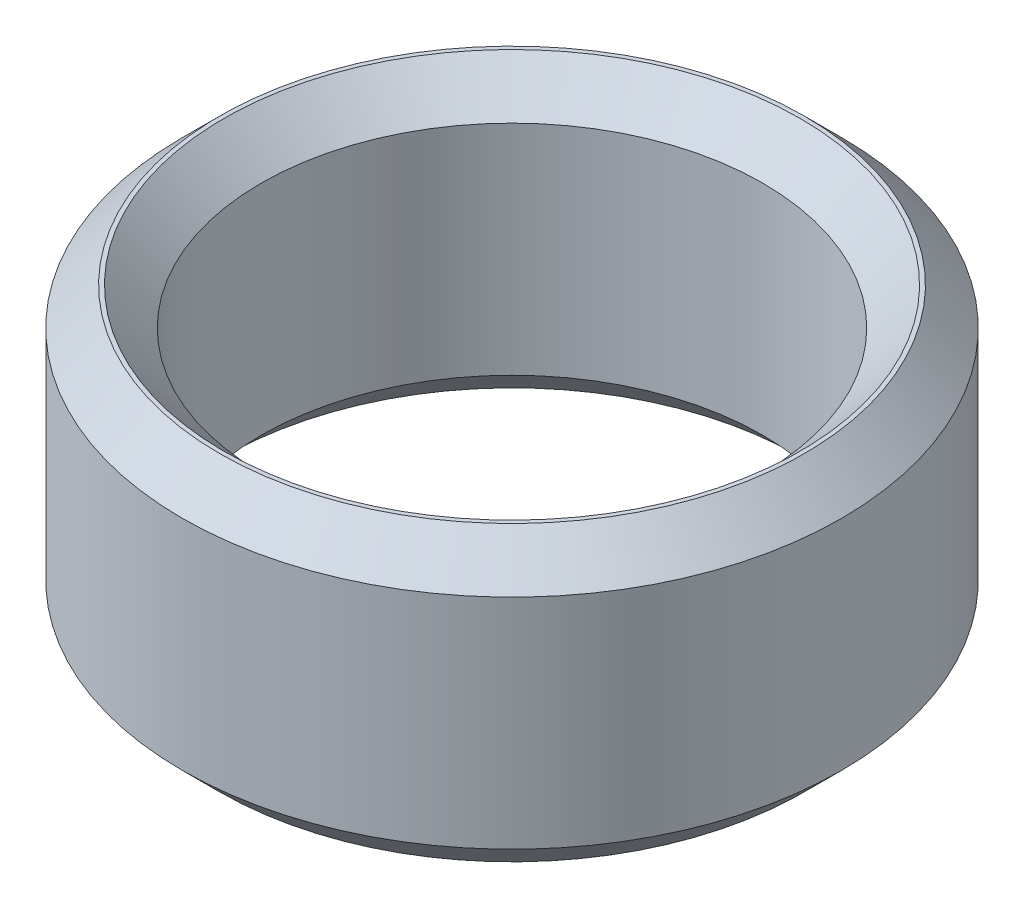
ISO-10303-21;
HEADER;
FILE_DESCRIPTION(('STEP AP214'),'2;1');
FILE_NAME('part.step','',(''),(''),'','','');
FILE_SCHEMA(('AUTOMOTIVE_DESIGN { 1 0 10303 214 1 1 1 1 }'));
ENDSEC;
DATA;
#1=APPLICATION_CONTEXT('core data for automotive mechanical design processes');
#2=APPLICATION_PROTOCOL_DEFINITION('international standard','automotive_design',2000,#1);
#3=PRODUCT_CONTEXT('',#1,'mechanical');
#4=PRODUCT('Part','Part','',(#3));
#5=PRODUCT_RELATED_PRODUCT_CATEGORY('part','',(#4));
#6=PRODUCT_DEFINITION_FORMATION('','',#4);
#7=PRODUCT_DEFINITION_CONTEXT('part definition',#1,'design');
#8=PRODUCT_DEFINITION('design','',#6,#7);
#9=PRODUCT_DEFINITION_SHAPE('','',#8);
#10=(LENGTH_UNIT() NAMED_UNIT(*) SI_UNIT(.MILLI.,.METRE.));
#11=(NAMED_UNIT(*) PLANE_ANGLE_UNIT() SI_UNIT($,.RADIAN.));
#12=(NAMED_UNIT(*) SI_UNIT($,.STERADIAN.) SOLID_ANGLE_UNIT());
#13=UNCERTAINTY_MEASURE_WITH_UNIT(LENGTH_MEASURE(1.E-05),#10,'distance_accuracy_value','');
#14=(GEOMETRIC_REPRESENTATION_CONTEXT(3) GLOBAL_UNCERTAINTY_ASSIGNED_CONTEXT((#13)) GLOBAL_UNIT_ASSIGNED_CONTEXT((#10,
#11,#12)) REPRESENTATION_CONTEXT('',''));
#15=CARTESIAN_POINT('',(0.,0.,0.));
#16=DIRECTION('',(0.,0.,1.));
#17=DIRECTION('',(1.,0.,0.));
#18=AXIS2_PLACEMENT_3D('',#15,#16,#17);
#19=CARTESIAN_POINT('',(0.,11.109307119717,0.));
#20=DIRECTION('',(0.,-1.,0.));
#21=DIRECTION('',(0.,0.,-1.));
#22=AXIS2_PLACEMENT_3D('',#19,#20,#21);
#23=CYLINDRICAL_SURFACE('',#22,12.5);
#24=CARTESIAN_POINT('',(0.,1.4161523422437,0.));
#25=DIRECTION('',(0.,1.,0.));
#26=DIRECTION('',(0.,0.,1.));
#27=AXIS2_PLACEMENT_3D('',#24,#25,#26);
#28=CIRCLE('',#27,12.5);
#29=CARTESIAN_POINT('',(0.,1.4161523422437,-12.5));
#30=VERTEX_POINT('',#29);
#31=EDGE_CURVE('E10',#30,#30,#28,.T.);
#32=CARTESIAN_POINT('',(0.,9.69315477747331,0.));
#33=DIRECTION('',(0.,1.,0.));
#34=DIRECTION('',(0.,0.,1.));
#35=AXIS2_PLACEMENT_3D('',#32,#33,#34);
#36=CIRCLE('',#35,12.5);
#37=CARTESIAN_POINT('',(0.,9.69315477747331,-12.5));
#38=VERTEX_POINT('',#37);
#39=EDGE_CURVE('E50',#38,#38,#36,.F.);
#40=CARTESIAN_POINT('',(0.,1.4161523422437,-12.5));
#41=CARTESIAN_POINT('',(0.,1.50237111761067,-12.5));
#42=CARTESIAN_POINT('',(0.,1.58858989297765,-12.5));
#43=CARTESIAN_POINT('',(0.,1.7610274437116,-12.5));
#44=CARTESIAN_POINT('',(0.,1.84724621907857,-12.5));
#45=CARTESIAN_POINT('',(0.,2.01968376981252,-12.5));
#46=CARTESIAN_POINT('',(0.,2.1059025451795,-12.5));
#47=CARTESIAN_POINT('',(0.,2.27834009591345,-12.5));
#48=CARTESIAN_POINT('',(0.,2.36455887128043,-12.5));
#49=CARTESIAN_POINT('',(0.,2.53699642201437,-12.5));
#50=CARTESIAN_POINT('',(0.,2.62321519738135,-12.5));
#51=CARTESIAN_POINT('',(0.,2.7956527481153,-12.5));
#52=CARTESIAN_POINT('',(0.,2.88187152348228,-12.5));
#53=CARTESIAN_POINT('',(0.,3.05430907421623,-12.5));
#54=CARTESIAN_POINT('',(0.,3.1405278495832,-12.5));
#55=CARTESIAN_POINT('',(0.,3.31296540031715,-12.5));
#56=CARTESIAN_POINT('',(0.,3.39918417568413,-12.5));
#57=CARTESIAN_POINT('',(0.,3.57162172641807,-12.5));
#58=CARTESIAN_POINT('',(0.,3.65784050178505,-12.5));
#59=CARTESIAN_POINT('',(0.,3.830278052519,-12.5));
#60=CARTESIAN_POINT('',(0.,3.91649682788598,-12.5));
#61=CARTESIAN_POINT('',(0.,4.08893437861993,-12.5));
#62=CARTESIAN_POINT('',(0.,4.1751531539869,-12.5));
#63=CARTESIAN_POINT('',(0.,4.34759070472085,-12.5));
#64=CARTESIAN_POINT('',(0.,4.43380948008783,-12.5));
#65=CARTESIAN_POINT('',(0.,4.60624703082178,-12.5));
#66=CARTESIAN_POINT('',(0.,4.69246580618875,-12.5));
#67=CARTESIAN_POINT('',(0.,4.8649033569227,-12.5));
#68=CARTESIAN_POINT('',(0.,4.95112213228968,-12.5));
#69=CARTESIAN_POINT('',(0.,5.12355968302363,-12.5));
#70=CARTESIAN_POINT('',(0.,5.2097784583906,-12.5));
#71=CARTESIAN_POINT('',(0.,5.38221600912455,-12.5));
#72=CARTESIAN_POINT('',(0.,5.46843478449153,-12.5));
#73=CARTESIAN_POINT('',(0.,5.64087233522548,-12.5));
#74=CARTESIAN_POINT('',(0.,5.72709111059245,-12.5));
#75=CARTESIAN_POINT('',(0.,5.8995286613264,-12.5));
#76=CARTESIAN_POINT('',(0.,5.98574743669338,-12.5));
#77=CARTESIAN_POINT('',(0.,6.15818498742733,-12.5));
#78=CARTESIAN_POINT('',(0.,6.2444037627943,-12.5));
#79=CARTESIAN_POINT('',(0.,6.41684131352825,-12.5));
#80=CARTESIAN_POINT('',(0.,6.50306008889523,-12.5));
#81=CARTESIAN_POINT('',(0.,6.67549763962918,-12.5));
#82=CARTESIAN_POINT('',(0.,6.76171641499615,-12.5));
#83=CARTESIAN_POINT('',(0.,6.9341539657301,-12.5));
#84=CARTESIAN_POINT('',(0.,7.02037274109708,-12.5));
#85=CARTESIAN_POINT('',(0.,7.19281029183103,-12.5));
#86=CARTESIAN_POINT('',(0.,7.279029067198,-12.5));
#87=CARTESIAN_POINT('',(0.,7.45146661793195,-12.5));
#88=CARTESIAN_POINT('',(0.,7.53768539329893,-12.5));
#89=CARTESIAN_POINT('',(0.,7.71012294403288,-12.5));
#90=CARTESIAN_POINT('',(0.,7.79634171939985,-12.5));
#91=CARTESIAN_POINT('',(0.,7.9687792701338,-12.5));
#92=CARTESIAN_POINT('',(0.,8.05499804550078,-12.5));
#93=CARTESIAN_POINT('',(0.,8.22743559623473,-12.5));
#94=CARTESIAN_POINT('',(0.,8.3136543716017,-12.5));
#95=CARTESIAN_POINT('',(0.,8.48609192233565,-12.5));
#96=CARTESIAN_POINT('',(0.,8.57231069770263,-12.5));
#97=CARTESIAN_POINT('',(0.,8.74474824843658,-12.5));
#98=CARTESIAN_POINT('',(0.,8.83096702380356,-12.5));
#99=CARTESIAN_POINT('',(0.,9.0034045745375,-12.5));
#100=CARTESIAN_POINT('',(0.,9.08962334990448,-12.5));
#101=CARTESIAN_POINT('',(0.,9.26206090063843,-12.5));
#102=CARTESIAN_POINT('',(0.,9.34827967600541,-12.5));
#103=CARTESIAN_POINT('',(0.,9.52071722673935,-12.5));
#104=CARTESIAN_POINT('',(0.,9.60693600210633,-12.5));
#105=CARTESIAN_POINT('',(0.,9.69315477747331,-12.5));
#106=B_SPLINE_CURVE_WITH_KNOTS('',3,(#40,#41,#42,#43,#44,#45,#46,#47,#48,#49,#50,#51,#52,#53,
#54,#55,#56,#57,#58,#59,#60,#61,#62,#63,#64,#65,#66,#67,#68,#69,#70,#71,#72,#73,#74,#75,#76,#77,
#78,#79,#80,#81,#82,#83,#84,#85,#86,#87,#88,#89,#90,#91,#92,#93,#94,#95,#96,#97,#98,#99,#100,
#101,#102,#103,#104,#105),.UNSPECIFIED.,.F.,.F.,(4,2,2,2,2,2,2,2,2,2,2,2,2,2,2,2,2,2,2,2,2,2,2,
2,2,2,2,2,2,2,2,2,4),(0.,0.258656326100925,0.517312652201851,0.775968978302776,1.0346253044037,
1.29328163050463,1.55193795660555,1.81059428270648,2.0692506088074,2.32790693490833,
2.58656326100925,2.84521958711018,3.1038759132111,3.36253223931203,3.62118856541295,
3.87984489151388,4.1385012176148,4.39715754371573,4.65581386981665,4.91447019591758,
5.1731265220185,5.43178284811943,5.69043917422035,5.94909550032128,6.2077518264222,
6.46640815252313,6.72506447862405,6.98372080472498,7.24237713082591,7.50103345692683,
7.75968978302776,8.01834610912868,8.27700243522961),.UNSPECIFIED.);
#107=EDGE_CURVE('BSEAM39',#30,#38,#106,.T.);
#108=ORIENTED_EDGE('',*,*,#31,.T.);
#109=ORIENTED_EDGE('',*,*,#39,.T.);
#110=ORIENTED_EDGE('',*,*,#107,.T.);
#111=ORIENTED_EDGE('',*,*,#107,.F.);
#112=EDGE_LOOP('',(#108,#110,#109,#111));
#113=FACE_BOUND('',#112,.T.);
#114=ADVANCED_FACE('F39',(#113),#23,.T.);
#115=CARTESIAN_POINT('',(0.,11.109307119717,0.));
#116=DIRECTION('',(0.,1.,0.));
#117=DIRECTION('',(0.,0.,1.));
#118=AXIS2_PLACEMENT_3D('',#115,#116,#117);
#119=PLANE('',#118);
#120=CARTESIAN_POINT('',(0.,11.109307119717,0.));
#121=DIRECTION('',(0.,1.,0.));
#122=DIRECTION('',(0.,0.,1.));
#123=AXIS2_PLACEMENT_3D('',#120,#121,#122);
#124=CIRCLE('',#123,10.9263904499153);
#125=CARTESIAN_POINT('',(0.,11.109307119717,10.9263904499153));
#126=VERTEX_POINT('',#125);
#127=EDGE_CURVE('E58',#126,#126,#124,.F.);
#128=ORIENTED_EDGE('',*,*,#127,.T.);
#129=EDGE_LOOP('',(#128));
#130=FACE_BOUND('',#129,.T.);
#131=CARTESIAN_POINT('',(0.,11.109307119717,0.));
#132=DIRECTION('',(0.,1.,0.));
#133=DIRECTION('',(0.,0.,1.));
#134=AXIS2_PLACEMENT_3D('',#131,#132,#133);
#135=CIRCLE('',#134,11.0838476577563);
#136=CARTESIAN_POINT('',(0.,11.109307119717,11.0838476577563));
#137=VERTEX_POINT('',#136);
#138=EDGE_CURVE('E61',#137,#137,#135,.T.);
#139=ORIENTED_EDGE('',*,*,#138,.T.);
#140=EDGE_LOOP('',(#139));
#141=FACE_BOUND('',#140,.T.);
#142=ADVANCED_FACE('F88',(#130,#141),#119,.T.);
#143=CARTESIAN_POINT('',(0.,0.,0.));
#144=DIRECTION('',(0.,1.,0.));
#145=DIRECTION('',(0.,0.,1.));
#146=AXIS2_PLACEMENT_3D('',#143,#144,#145);
#147=PLANE('',#146);
#148=CARTESIAN_POINT('',(0.,0.,0.));
#149=DIRECTION('',(0.,1.,0.));
#150=DIRECTION('',(0.,0.,1.));
#151=AXIS2_PLACEMENT_3D('',#148,#149,#150);
#152=CIRCLE('',#151,10.9263904499153);
#153=CARTESIAN_POINT('',(0.,0.,10.9263904499153));
#154=VERTEX_POINT('',#153);
#155=EDGE_CURVE('E51',#154,#154,#152,.T.);
#156=ORIENTED_EDGE('',*,*,#155,.T.);
#157=EDGE_LOOP('',(#156));
#158=FACE_BOUND('',#157,.T.);
#159=CARTESIAN_POINT('',(0.,0.,0.));
#160=DIRECTION('',(0.,1.,0.));
#161=DIRECTION('',(0.,0.,1.));
#162=AXIS2_PLACEMENT_3D('',#159,#160,#161);
#163=CIRCLE('',#162,11.0838476577563);
#164=CARTESIAN_POINT('',(0.,0.,11.0838476577563));
#165=VERTEX_POINT('',#164);
#166=EDGE_CURVE('E54',#165,#165,#163,.F.);
#167=ORIENTED_EDGE('',*,*,#166,.T.);
#168=EDGE_LOOP('',(#167));
#169=FACE_BOUND('',#168,.T.);
#170=ADVANCED_FACE('F83',(#158,#169),#147,.F.);
#171=CARTESIAN_POINT('',(0.,11.109307119717,0.));
#172=DIRECTION('',(0.,-1.,0.));
#173=DIRECTION('',(0.,0.,-1.));
#174=AXIS2_PLACEMENT_3D('',#171,#172,#173);
#175=CYLINDRICAL_SURFACE('',#174,9.51023810767161);
#176=CARTESIAN_POINT('',(0.,9.69315477747328,0.));
#177=DIRECTION('',(0.,1.,0.));
#178=DIRECTION('',(0.,0.,1.));
#179=AXIS2_PLACEMENT_3D('',#176,#177,#178);
#180=CIRCLE('',#179,9.51023810767161);
#181=CARTESIAN_POINT('',(0.,9.69315477747328,-9.51023810767161));
#182=VERTEX_POINT('',#181);
#183=EDGE_CURVE('E67',#182,#182,#180,.T.);
#184=CARTESIAN_POINT('',(0.,1.41615234224368,0.));
#185=DIRECTION('',(0.,1.,0.));
#186=DIRECTION('',(0.,0.,1.));
#187=AXIS2_PLACEMENT_3D('',#184,#185,#186);
#188=CIRCLE('',#187,9.51023810767161);
#189=CARTESIAN_POINT('',(0.,1.41615234224367,-9.51023810767161));
#190=VERTEX_POINT('',#189);
#191=EDGE_CURVE('E69',#190,#190,#188,.F.);
#192=CARTESIAN_POINT('',(0.,9.69315477747328,-9.51023810767161));
#193=CARTESIAN_POINT('',(0.,9.60693600210631,-9.51023810767161));
#194=CARTESIAN_POINT('',(0.,9.52071722673933,-9.51023810767161));
#195=CARTESIAN_POINT('',(0.,9.34827967600538,-9.51023810767161));
#196=CARTESIAN_POINT('',(0.,9.26206090063841,-9.51023810767161));
#197=CARTESIAN_POINT('',(0.,9.08962334990446,-9.51023810767161));
#198=CARTESIAN_POINT('',(0.,9.00340457453748,-9.51023810767161));
#199=CARTESIAN_POINT('',(0.,8.83096702380353,-9.51023810767161));
#200=CARTESIAN_POINT('',(0.,8.74474824843656,-9.51023810767161));
#201=CARTESIAN_POINT('',(0.,8.57231069770261,-9.51023810767161));
#202=CARTESIAN_POINT('',(0.,8.48609192233563,-9.51023810767161));
#203=CARTESIAN_POINT('',(0.,8.31365437160168,-9.51023810767161));
#204=CARTESIAN_POINT('',(0.,8.22743559623471,-9.51023810767161));
#205=CARTESIAN_POINT('',(0.,8.05499804550076,-9.51023810767161));
#206=CARTESIAN_POINT('',(0.,7.96877927013378,-9.51023810767161));
#207=CARTESIAN_POINT('',(0.,7.79634171939983,-9.51023810767161));
#208=CARTESIAN_POINT('',(0.,7.71012294403286,-9.51023810767161));
#209=CARTESIAN_POINT('',(0.,7.53768539329891,-9.51023810767161));
#210=CARTESIAN_POINT('',(0.,7.45146661793193,-9.51023810767161));
#211=CARTESIAN_POINT('',(0.,7.27902906719798,-9.51023810767161));
#212=CARTESIAN_POINT('',(0.,7.19281029183101,-9.51023810767161));
#213=CARTESIAN_POINT('',(0.,7.02037274109706,-9.51023810767161));
#214=CARTESIAN_POINT('',(0.,6.93415396573008,-9.51023810767161));
#215=CARTESIAN_POINT('',(0.,6.76171641499613,-9.51023810767161));
#216=CARTESIAN_POINT('',(0.,6.67549763962916,-9.51023810767161));
#217=CARTESIAN_POINT('',(0.,6.50306008889521,-9.51023810767161));
#218=CARTESIAN_POINT('',(0.,6.41684131352823,-9.51023810767161));
#219=CARTESIAN_POINT('',(0.,6.24440376279428,-9.51023810767161));
#220=CARTESIAN_POINT('',(0.,6.1581849874273,-9.51023810767161));
#221=CARTESIAN_POINT('',(0.,5.98574743669335,-9.51023810767161));
#222=CARTESIAN_POINT('',(0.,5.89952866132638,-9.51023810767161));
#223=CARTESIAN_POINT('',(0.,5.72709111059243,-9.51023810767161));
#224=CARTESIAN_POINT('',(0.,5.64087233522545,-9.51023810767161));
#225=CARTESIAN_POINT('',(0.,5.4684347844915,-9.51023810767161));
#226=CARTESIAN_POINT('',(0.,5.38221600912453,-9.51023810767161));
#227=CARTESIAN_POINT('',(0.,5.20977845839058,-9.51023810767161));
#228=CARTESIAN_POINT('',(0.,5.1235596830236,-9.51023810767161));
#229=CARTESIAN_POINT('',(0.,4.95112213228965,-9.51023810767161));
#230=CARTESIAN_POINT('',(0.,4.86490335692268,-9.51023810767161));
#231=CARTESIAN_POINT('',(0.,4.69246580618873,-9.51023810767161));
#232=CARTESIAN_POINT('',(0.,4.60624703082175,-9.51023810767161));
#233=CARTESIAN_POINT('',(0.,4.4338094800878,-9.51023810767161));
#234=CARTESIAN_POINT('',(0.,4.34759070472083,-9.51023810767161));
#235=CARTESIAN_POINT('',(0.,4.17515315398688,-9.51023810767161));
#236=CARTESIAN_POINT('',(0.,4.0889343786199,-9.51023810767161));
#237=CARTESIAN_POINT('',(0.,3.91649682788595,-9.51023810767161));
#238=CARTESIAN_POINT('',(0.,3.83027805251898,-9.51023810767161));
#239=CARTESIAN_POINT('',(0.,3.65784050178503,-9.51023810767161));
#240=CARTESIAN_POINT('',(0.,3.57162172641805,-9.51023810767161));
#241=CARTESIAN_POINT('',(0.,3.3991841756841,-9.51023810767161));
#242=CARTESIAN_POINT('',(0.,3.31296540031713,-9.51023810767161));
#243=CARTESIAN_POINT('',(0.,3.14052784958318,-9.51023810767161));
#244=CARTESIAN_POINT('',(0.,3.0543090742162,-9.51023810767161));
#245=CARTESIAN_POINT('',(0.,2.88187152348225,-9.51023810767161));
#246=CARTESIAN_POINT('',(0.,2.79565274811528,-9.51023810767161));
#247=CARTESIAN_POINT('',(0.,2.62321519738133,-9.51023810767161));
#248=CARTESIAN_POINT('',(0.,2.53699642201435,-9.51023810767161));
#249=CARTESIAN_POINT('',(0.,2.3645588712804,-9.51023810767161));
#250=CARTESIAN_POINT('',(0.,2.27834009591342,-9.51023810767161));
#251=CARTESIAN_POINT('',(0.,2.10590254517947,-9.51023810767161));
#252=CARTESIAN_POINT('',(0.,2.0196837698125,-9.51023810767161));
#253=CARTESIAN_POINT('',(0.,1.84724621907855,-9.51023810767161));
#254=CARTESIAN_POINT('',(0.,1.76102744371157,-9.51023810767161));
#255=CARTESIAN_POINT('',(0.,1.58858989297762,-9.51023810767161));
#256=CARTESIAN_POINT('',(0.,1.50237111761065,-9.51023810767161));
#257=CARTESIAN_POINT('',(0.,1.41615234224367,-9.51023810767161));
#258=B_SPLINE_CURVE_WITH_KNOTS('',3,(#192,#193,#194,#195,#196,#197,#198,#199,#200,#201,#202,
#203,#204,#205,#206,#207,#208,#209,#210,#211,#212,#213,#214,#215,#216,#217,#218,#219,#220,#221,
#222,#223,#224,#225,#226,#227,#228,#229,#230,#231,#232,#233,#234,#235,#236,#237,#238,#239,#240,
#241,#242,#243,#244,#245,#246,#247,#248,#249,#250,#251,#252,#253,#254,#255,#256,#257),
.UNSPECIFIED.,.F.,.F.,(4,2,2,2,2,2,2,2,2,2,2,2,2,2,2,2,2,2,2,2,2,2,2,2,2,2,2,2,2,2,2,2,4),(0.,
0.258656326100925,0.517312652201852,0.775968978302776,1.0346253044037,1.29328163050463,
1.55193795660555,1.81059428270648,2.0692506088074,2.32790693490833,2.58656326100925,
2.84521958711018,3.1038759132111,3.36253223931203,3.62118856541296,3.87984489151388,
4.13850121761481,4.39715754371573,4.65581386981666,4.91447019591758,5.17312652201851,
5.43178284811943,5.69043917422036,5.94909550032128,6.20775182642221,6.46640815252313,
6.72506447862406,6.98372080472498,7.24237713082591,7.50103345692684,7.75968978302776,
8.01834610912869,8.27700243522961),.UNSPECIFIED.);
#259=EDGE_CURVE('BSEAM71',#182,#190,#258,.T.);
#260=ORIENTED_EDGE('',*,*,#183,.T.);
#261=ORIENTED_EDGE('',*,*,#191,.T.);
#262=ORIENTED_EDGE('',*,*,#259,.T.);
#263=ORIENTED_EDGE('',*,*,#259,.F.);
#264=EDGE_LOOP('',(#260,#262,#261,#263));
#265=FACE_BOUND('',#264,.T.);
#266=ADVANCED_FACE('F71',(#265),#175,.F.);
#267=CARTESIAN_POINT('',(0.,9.69315477747328,0.));
#268=DIRECTION('',(0.,1.,0.));
#269=DIRECTION('',(0.,0.,1.));
#270=AXIS2_PLACEMENT_3D('',#267,#268,#269);
#271=CONICAL_SURFACE('',#270,9.51023810767161,0.785398163397452);
#272=ORIENTED_EDGE('',*,*,#127,.F.);
#273=EDGE_LOOP('',(#272));
#274=FACE_BOUND('',#273,.T.);
#275=ORIENTED_EDGE('',*,*,#183,.F.);
#276=EDGE_LOOP('',(#275));
#277=FACE_BOUND('',#276,.T.);
#278=ADVANCED_FACE('F77',(#274,#277),#271,.F.);
#279=CARTESIAN_POINT('',(0.,0.,0.));
#280=DIRECTION('',(0.,-1.,0.));
#281=DIRECTION('',(0.,0.,-1.));
#282=AXIS2_PLACEMENT_3D('',#279,#280,#281);
#283=CONICAL_SURFACE('',#282,10.9263904499153,0.785398163397444);
#284=ORIENTED_EDGE('',*,*,#191,.F.);
#285=EDGE_LOOP('',(#284));
#286=FACE_BOUND('',#285,.T.);
#287=ORIENTED_EDGE('',*,*,#155,.F.);
#288=EDGE_LOOP('',(#287));
#289=FACE_BOUND('',#288,.T.);
#290=ADVANCED_FACE('F73',(#286,#289),#283,.F.);
#291=CARTESIAN_POINT('',(0.,1.4161523422437,0.));
#292=DIRECTION('',(0.,1.,0.));
#293=DIRECTION('',(0.,0.,1.));
#294=AXIS2_PLACEMENT_3D('',#291,#292,#293);
#295=CONICAL_SURFACE('',#294,12.5,0.785398163397452);
#296=ORIENTED_EDGE('',*,*,#166,.F.);
#297=EDGE_LOOP('',(#296));
#298=FACE_BOUND('',#297,.T.);
#299=ORIENTED_EDGE('',*,*,#31,.F.);
#300=EDGE_LOOP('',(#299));
#301=FACE_BOUND('',#300,.T.);
#302=ADVANCED_FACE('F76',(#298,#301),#295,.T.);
#303=CARTESIAN_POINT('',(0.,11.109307119717,0.));
#304=DIRECTION('',(0.,-1.,0.));
#305=DIRECTION('',(0.,0.,-1.));
#306=AXIS2_PLACEMENT_3D('',#303,#304,#305);
#307=CONICAL_SURFACE('',#306,11.0838476577563,0.785398163397445);
#308=ORIENTED_EDGE('',*,*,#39,.F.);
#309=EDGE_LOOP('',(#308));
#310=FACE_BOUND('',#309,.T.);
#311=ORIENTED_EDGE('',*,*,#138,.F.);
#312=EDGE_LOOP('',(#311));
#313=FACE_BOUND('',#312,.T.);
#314=ADVANCED_FACE('F45',(#310,#313),#307,.T.);
#315=CLOSED_SHELL('',(#114,#142,#170,#266,#278,#290,#302,#314));
#316=MANIFOLD_SOLID_BREP('B2',#315);
#317=ADVANCED_BREP_SHAPE_REPRESENTATION('',(#18,#316),#14);
#318=SHAPE_DEFINITION_REPRESENTATION(#9,#317);
ENDSEC;
END-ISO-10303-21;
